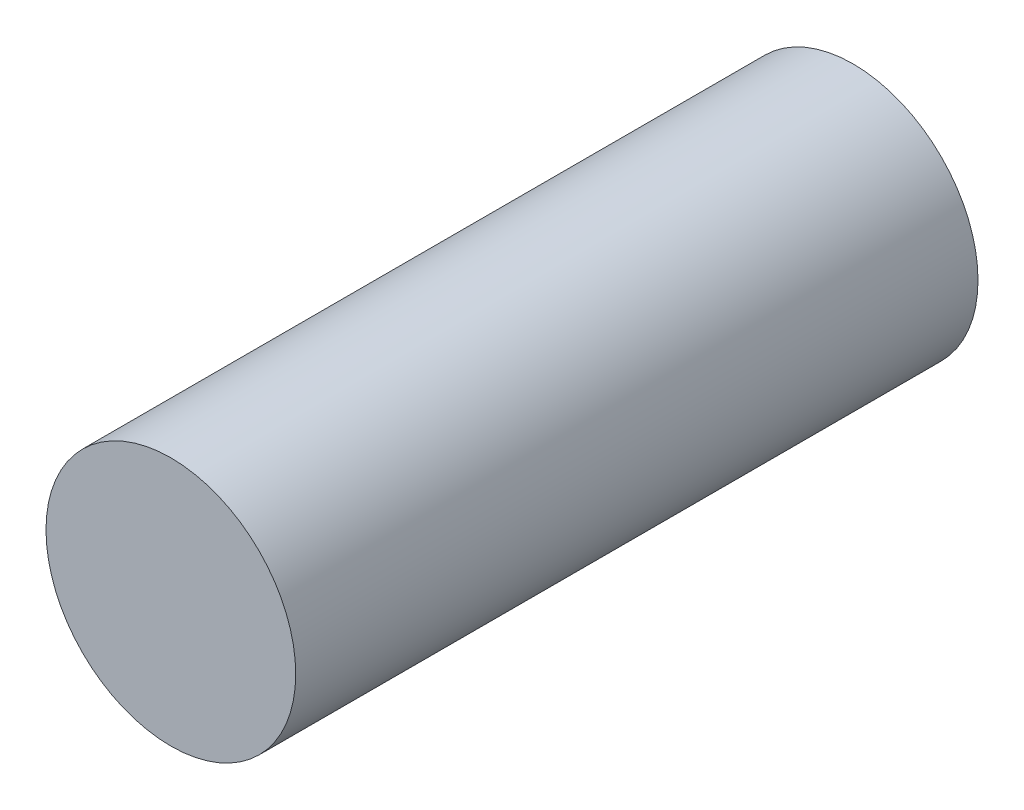
ISO-10303-21;
HEADER;
FILE_DESCRIPTION(('STEP AP214'),'2;1');
FILE_NAME('part.step','',(''),(''),'','','');
FILE_SCHEMA(('AUTOMOTIVE_DESIGN { 1 0 10303 214 1 1 1 1 }'));
ENDSEC;
DATA;
#1=APPLICATION_CONTEXT('core data for automotive mechanical design processes');
#2=APPLICATION_PROTOCOL_DEFINITION('international standard','automotive_design',2000,#1);
#3=PRODUCT_CONTEXT('',#1,'mechanical');
#4=PRODUCT('Part','Part','',(#3));
#5=PRODUCT_RELATED_PRODUCT_CATEGORY('part','',(#4));
#6=PRODUCT_DEFINITION_FORMATION('','',#4);
#7=PRODUCT_DEFINITION_CONTEXT('part definition',#1,'design');
#8=PRODUCT_DEFINITION('design','',#6,#7);
#9=PRODUCT_DEFINITION_SHAPE('','',#8);
#10=(LENGTH_UNIT() NAMED_UNIT(*) SI_UNIT(.MILLI.,.METRE.));
#11=(NAMED_UNIT(*) PLANE_ANGLE_UNIT() SI_UNIT($,.RADIAN.));
#12=(NAMED_UNIT(*) SI_UNIT($,.STERADIAN.) SOLID_ANGLE_UNIT());
#13=UNCERTAINTY_MEASURE_WITH_UNIT(LENGTH_MEASURE(1.E-05),#10,'distance_accuracy_value','');
#14=(GEOMETRIC_REPRESENTATION_CONTEXT(3) GLOBAL_UNCERTAINTY_ASSIGNED_CONTEXT((#13)) GLOBAL_UNIT_ASSIGNED_CONTEXT((#10,
#11,#12)) REPRESENTATION_CONTEXT('',''));
#15=CARTESIAN_POINT('',(0.,0.,0.));
#16=DIRECTION('',(0.,0.,1.));
#17=DIRECTION('',(1.,0.,0.));
#18=AXIS2_PLACEMENT_3D('',#15,#16,#17);
#19=CARTESIAN_POINT('',(0.,0.,150.));
#20=DIRECTION('',(0.,0.,-1.));
#21=DIRECTION('',(-1.,0.,0.));
#22=AXIS2_PLACEMENT_3D('',#19,#20,#21);
#23=CYLINDRICAL_SURFACE('',#22,27.451016564818);
#24=CARTESIAN_POINT('',(0.,0.,150.));
#25=DIRECTION('',(0.,0.,1.));
#26=DIRECTION('',(1.,0.,0.));
#27=AXIS2_PLACEMENT_3D('',#24,#25,#26);
#28=CIRCLE('',#27,27.451016564818);
#29=CARTESIAN_POINT('',(27.451016564818,0.,150.));
#30=VERTEX_POINT('',#29);
#31=EDGE_CURVE('E10',#30,#30,#28,.T.);
#32=ORIENTED_EDGE('',*,*,#31,.F.);
#33=EDGE_LOOP('',(#32));
#34=FACE_BOUND('',#33,.T.);
#35=CARTESIAN_POINT('',(0.,0.,0.));
#36=DIRECTION('',(0.,0.,1.));
#37=DIRECTION('',(1.,0.,0.));
#38=AXIS2_PLACEMENT_3D('',#35,#36,#37);
#39=CIRCLE('',#38,27.451016564818);
#40=CARTESIAN_POINT('',(27.451016564818,0.,0.));
#41=VERTEX_POINT('',#40);
#42=EDGE_CURVE('E40',#41,#41,#39,.T.);
#43=ORIENTED_EDGE('',*,*,#42,.T.);
#44=EDGE_LOOP('',(#43));
#45=FACE_BOUND('',#44,.T.);
#46=ADVANCED_FACE('F37',(#34,#45),#23,.T.);
#47=CARTESIAN_POINT('',(0.,0.,150.));
#48=DIRECTION('',(0.,0.,1.));
#49=DIRECTION('',(1.,0.,0.));
#50=AXIS2_PLACEMENT_3D('',#47,#48,#49);
#51=PLANE('',#50);
#52=ORIENTED_EDGE('',*,*,#31,.T.);
#53=EDGE_LOOP('',(#52));
#54=FACE_BOUND('',#53,.T.);
#55=ADVANCED_FACE('F52',(#54),#51,.T.);
#56=CARTESIAN_POINT('',(0.,0.,0.));
#57=DIRECTION('',(0.,0.,1.));
#58=DIRECTION('',(1.,0.,0.));
#59=AXIS2_PLACEMENT_3D('',#56,#57,#58);
#60=PLANE('',#59);
#61=ORIENTED_EDGE('',*,*,#42,.F.);
#62=EDGE_LOOP('',(#61));
#63=FACE_BOUND('',#62,.T.);
#64=ADVANCED_FACE('F50',(#63),#60,.F.);
#65=CLOSED_SHELL('',(#46,#55,#64));
#66=MANIFOLD_SOLID_BREP('B2',#65);
#67=ADVANCED_BREP_SHAPE_REPRESENTATION('',(#18,#66),#14);
#68=SHAPE_DEFINITION_REPRESENTATION(#9,#67);
ENDSEC;
END-ISO-10303-21;
